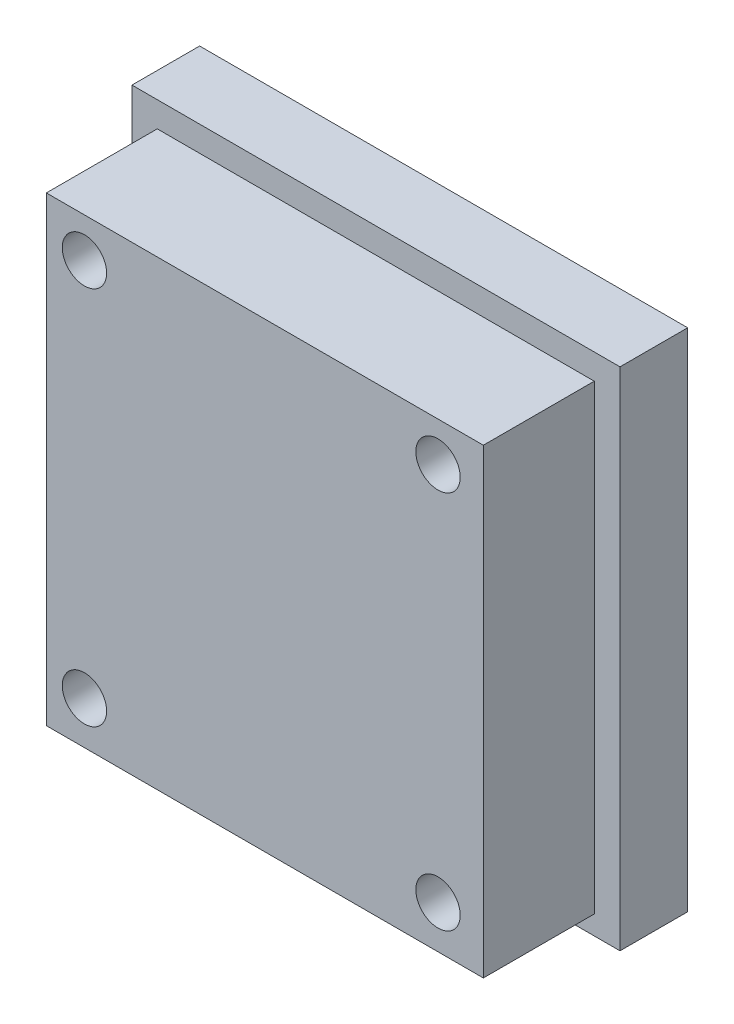
ISO-10303-21;
HEADER;
FILE_DESCRIPTION(('STEP AP214'),'2;1');
FILE_NAME('part.step','',(''),(''),'','','');
FILE_SCHEMA(('AUTOMOTIVE_DESIGN { 1 0 10303 214 1 1 1 1 }'));
ENDSEC;
DATA;
#1=APPLICATION_CONTEXT('core data for automotive mechanical design processes');
#2=APPLICATION_PROTOCOL_DEFINITION('international standard','automotive_design',2000,#1);
#3=PRODUCT_CONTEXT('',#1,'mechanical');
#4=PRODUCT('Part','Part','',(#3));
#5=PRODUCT_RELATED_PRODUCT_CATEGORY('part','',(#4));
#6=PRODUCT_DEFINITION_FORMATION('','',#4);
#7=PRODUCT_DEFINITION_CONTEXT('part definition',#1,'design');
#8=PRODUCT_DEFINITION('design','',#6,#7);
#9=PRODUCT_DEFINITION_SHAPE('','',#8);
#10=(LENGTH_UNIT() NAMED_UNIT(*) SI_UNIT(.MILLI.,.METRE.));
#11=(NAMED_UNIT(*) PLANE_ANGLE_UNIT() SI_UNIT($,.RADIAN.));
#12=(NAMED_UNIT(*) SI_UNIT($,.STERADIAN.) SOLID_ANGLE_UNIT());
#13=UNCERTAINTY_MEASURE_WITH_UNIT(LENGTH_MEASURE(1.E-05),#10,'distance_accuracy_value','');
#14=(GEOMETRIC_REPRESENTATION_CONTEXT(3) GLOBAL_UNCERTAINTY_ASSIGNED_CONTEXT((#13)) GLOBAL_UNIT_ASSIGNED_CONTEXT((#10,
#11,#12)) REPRESENTATION_CONTEXT('',''));
#15=CARTESIAN_POINT('',(0.,0.,0.));
#16=DIRECTION('',(0.,0.,1.));
#17=DIRECTION('',(1.,0.,0.));
#18=AXIS2_PLACEMENT_3D('',#15,#16,#17);
#19=CARTESIAN_POINT('',(-24.06,19.62,16.1));
#20=DIRECTION('',(0.,1.,0.));
#21=DIRECTION('',(0.,0.,1.));
#22=AXIS2_PLACEMENT_3D('',#19,#20,#21);
#23=PLANE('',#22);
#24=DIRECTION('',(-1.,0.,0.));
#25=VECTOR('',#24,1.);
#26=CARTESIAN_POINT('',(-24.06,19.62,6.1));
#27=LINE('',#26,#25);
#28=CARTESIAN_POINT('',(15.34,19.62,6.1));
#29=VERTEX_POINT('',#28);
#30=CARTESIAN_POINT('',(-24.06,19.62,6.1));
#31=VERTEX_POINT('',#30);
#32=EDGE_CURVE('E60',#29,#31,#27,.T.);
#33=ORIENTED_EDGE('',*,*,#32,.T.);
#34=DIRECTION('',(0.,0.,-1.));
#35=VECTOR('',#34,1.);
#36=CARTESIAN_POINT('',(-24.06,19.62,16.1));
#37=LINE('',#36,#35);
#38=CARTESIAN_POINT('',(-24.06,19.62,16.1));
#39=VERTEX_POINT('',#38);
#40=EDGE_CURVE('E11',#39,#31,#37,.T.);
#41=ORIENTED_EDGE('',*,*,#40,.F.);
#42=DIRECTION('',(1.,0.,0.));
#43=VECTOR('',#42,1.);
#44=CARTESIAN_POINT('',(-24.06,19.62,16.1));
#45=LINE('',#44,#43);
#46=CARTESIAN_POINT('',(15.34,19.62,16.1));
#47=VERTEX_POINT('',#46);
#48=EDGE_CURVE('E176',#39,#47,#45,.T.);
#49=ORIENTED_EDGE('',*,*,#48,.T.);
#50=DIRECTION('',(0.,0.,-1.));
#51=VECTOR('',#50,1.);
#52=CARTESIAN_POINT('',(15.34,19.62,16.1));
#53=LINE('',#52,#51);
#54=EDGE_CURVE('E46',#47,#29,#53,.T.);
#55=ORIENTED_EDGE('',*,*,#54,.T.);
#56=EDGE_LOOP('',(#33,#41,#49,#55));
#57=FACE_BOUND('',#56,.T.);
#58=ADVANCED_FACE('F43',(#57),#23,.T.);
#59=CARTESIAN_POINT('',(-24.06,19.62,16.1));
#60=DIRECTION('',(1.,0.,0.));
#61=DIRECTION('',(0.,0.,-1.));
#62=AXIS2_PLACEMENT_3D('',#59,#60,#61);
#63=PLANE('',#62);
#64=ORIENTED_EDGE('',*,*,#40,.T.);
#65=DIRECTION('',(0.,-1.,0.));
#66=VECTOR('',#65,1.);
#67=CARTESIAN_POINT('',(-24.06,19.62,6.1));
#68=LINE('',#67,#66);
#69=CARTESIAN_POINT('',(-24.06,-21.98,6.1));
#70=VERTEX_POINT('',#69);
#71=EDGE_CURVE('E66',#31,#70,#68,.T.);
#72=ORIENTED_EDGE('',*,*,#71,.T.);
#73=DIRECTION('',(0.,0.,-1.));
#74=VECTOR('',#73,1.);
#75=CARTESIAN_POINT('',(-24.06,-21.98,16.1));
#76=LINE('',#75,#74);
#77=CARTESIAN_POINT('',(-24.06,-21.98,16.1));
#78=VERTEX_POINT('',#77);
#79=EDGE_CURVE('E52',#78,#70,#76,.T.);
#80=ORIENTED_EDGE('',*,*,#79,.F.);
#81=DIRECTION('',(0.,-1.,0.));
#82=VECTOR('',#81,1.);
#83=CARTESIAN_POINT('',(-24.06,19.62,16.1));
#84=LINE('',#83,#82);
#85=EDGE_CURVE('E185',#39,#78,#84,.T.);
#86=ORIENTED_EDGE('',*,*,#85,.F.);
#87=EDGE_LOOP('',(#64,#72,#80,#86));
#88=FACE_BOUND('',#87,.T.);
#89=ADVANCED_FACE('F194',(#88),#63,.F.);
#90=CARTESIAN_POINT('',(-24.06,-21.98,16.1));
#91=DIRECTION('',(0.,1.,0.));
#92=DIRECTION('',(0.,0.,1.));
#93=AXIS2_PLACEMENT_3D('',#90,#91,#92);
#94=PLANE('',#93);
#95=ORIENTED_EDGE('',*,*,#79,.T.);
#96=DIRECTION('',(1.,0.,0.));
#97=VECTOR('',#96,1.);
#98=CARTESIAN_POINT('',(-24.06,-21.98,6.1));
#99=LINE('',#98,#97);
#100=CARTESIAN_POINT('',(15.34,-21.98,6.1));
#101=VERTEX_POINT('',#100);
#102=EDGE_CURVE('E122',#70,#101,#99,.T.);
#103=ORIENTED_EDGE('',*,*,#102,.T.);
#104=DIRECTION('',(0.,0.,-1.));
#105=VECTOR('',#104,1.);
#106=CARTESIAN_POINT('',(15.34,-21.98,16.1));
#107=LINE('',#106,#105);
#108=CARTESIAN_POINT('',(15.34,-21.98,16.1));
#109=VERTEX_POINT('',#108);
#110=EDGE_CURVE('E111',#109,#101,#107,.T.);
#111=ORIENTED_EDGE('',*,*,#110,.F.);
#112=DIRECTION('',(1.,0.,0.));
#113=VECTOR('',#112,1.);
#114=CARTESIAN_POINT('',(-24.06,-21.98,16.1));
#115=LINE('',#114,#113);
#116=EDGE_CURVE('E182',#78,#109,#115,.T.);
#117=ORIENTED_EDGE('',*,*,#116,.F.);
#118=EDGE_LOOP('',(#95,#103,#111,#117));
#119=FACE_BOUND('',#118,.T.);
#120=ADVANCED_FACE('F123',(#119),#94,.F.);
#121=CARTESIAN_POINT('',(15.34,19.62,16.1));
#122=DIRECTION('',(1.,0.,0.));
#123=DIRECTION('',(0.,1.,0.));
#124=AXIS2_PLACEMENT_3D('',#121,#122,#123);
#125=PLANE('',#124);
#126=DIRECTION('',(0.,1.,0.));
#127=VECTOR('',#126,1.);
#128=CARTESIAN_POINT('',(15.34,19.62,6.1));
#129=LINE('',#128,#127);
#130=EDGE_CURVE('E115',#101,#29,#129,.T.);
#131=ORIENTED_EDGE('',*,*,#130,.T.);
#132=ORIENTED_EDGE('',*,*,#54,.F.);
#133=DIRECTION('',(0.,-1.,0.));
#134=VECTOR('',#133,1.);
#135=CARTESIAN_POINT('',(15.34,19.62,16.1));
#136=LINE('',#135,#134);
#137=EDGE_CURVE('E117',#47,#109,#136,.T.);
#138=ORIENTED_EDGE('',*,*,#137,.T.);
#139=ORIENTED_EDGE('',*,*,#110,.T.);
#140=EDGE_LOOP('',(#131,#132,#138,#139));
#141=FACE_BOUND('',#140,.T.);
#142=ADVANCED_FACE('F113',(#141),#125,.T.);
#143=CARTESIAN_POINT('',(0.,0.,16.1));
#144=DIRECTION('',(0.,0.,-1.));
#145=DIRECTION('',(-1.,0.,0.));
#146=AXIS2_PLACEMENT_3D('',#143,#144,#145);
#147=PLANE('',#146);
#148=CARTESIAN_POINT('',(11.2536911867013,-18.1252242686097,16.1));
#149=DIRECTION('',(0.,0.,1.));
#150=DIRECTION('',(1.,0.,0.));
#151=AXIS2_PLACEMENT_3D('',#148,#149,#150);
#152=CIRCLE('',#151,2.);
#153=CARTESIAN_POINT('',(13.2536911867013,-18.1252242686097,16.1));
#154=VERTEX_POINT('',#153);
#155=EDGE_CURVE('E277',#154,#154,#152,.T.);
#156=ORIENTED_EDGE('',*,*,#155,.F.);
#157=EDGE_LOOP('',(#156));
#158=FACE_BOUND('',#157,.T.);
#159=CARTESIAN_POINT('',(11.2536911867013,16.0742191790854,16.1));
#160=DIRECTION('',(0.,0.,1.));
#161=DIRECTION('',(1.,0.,0.));
#162=AXIS2_PLACEMENT_3D('',#159,#160,#161);
#163=CIRCLE('',#162,2.);
#164=CARTESIAN_POINT('',(13.2536911867013,16.0742191790854,16.1));
#165=VERTEX_POINT('',#164);
#166=EDGE_CURVE('E267',#165,#165,#163,.T.);
#167=ORIENTED_EDGE('',*,*,#166,.F.);
#168=EDGE_LOOP('',(#167));
#169=FACE_BOUND('',#168,.T.);
#170=CARTESIAN_POINT('',(-20.6239551828933,16.0742191790854,16.1));
#171=DIRECTION('',(0.,0.,1.));
#172=DIRECTION('',(1.,0.,0.));
#173=AXIS2_PLACEMENT_3D('',#170,#171,#172);
#174=CIRCLE('',#173,2.);
#175=CARTESIAN_POINT('',(-18.6239551828933,16.0742191790854,16.1));
#176=VERTEX_POINT('',#175);
#177=EDGE_CURVE('E257',#176,#176,#174,.T.);
#178=ORIENTED_EDGE('',*,*,#177,.F.);
#179=EDGE_LOOP('',(#178));
#180=FACE_BOUND('',#179,.T.);
#181=CARTESIAN_POINT('',(-20.6239551828933,-18.1252242686097,16.1));
#182=DIRECTION('',(0.,0.,1.));
#183=DIRECTION('',(1.,0.,0.));
#184=AXIS2_PLACEMENT_3D('',#181,#182,#183);
#185=CIRCLE('',#184,2.);
#186=CARTESIAN_POINT('',(-18.6239551828933,-18.1252242686097,16.1));
#187=VERTEX_POINT('',#186);
#188=EDGE_CURVE('E260',#187,#187,#185,.T.);
#189=ORIENTED_EDGE('',*,*,#188,.F.);
#190=EDGE_LOOP('',(#189));
#191=FACE_BOUND('',#190,.T.);
#192=ORIENTED_EDGE('',*,*,#48,.F.);
#193=ORIENTED_EDGE('',*,*,#85,.T.);
#194=ORIENTED_EDGE('',*,*,#116,.T.);
#195=ORIENTED_EDGE('',*,*,#137,.F.);
#196=EDGE_LOOP('',(#192,#193,#194,#195));
#197=FACE_BOUND('',#196,.T.);
#198=ADVANCED_FACE('F192',(#158,#169,#180,#191,#197),#147,.F.);
#199=CARTESIAN_POINT('',(0.,0.,6.1));
#200=DIRECTION('',(0.,0.,1.));
#201=DIRECTION('',(1.,0.,0.));
#202=AXIS2_PLACEMENT_3D('',#199,#200,#201);
#203=PLANE('',#202);
#204=DIRECTION('',(0.,-1.,0.));
#205=VECTOR('',#204,1.);
#206=CARTESIAN_POINT('',(-26.34,21.9,6.1));
#207=LINE('',#206,#205);
#208=CARTESIAN_POINT('',(-26.34,21.9,6.1));
#209=VERTEX_POINT('',#208);
#210=CARTESIAN_POINT('',(-26.34,-23.7,6.1));
#211=VERTEX_POINT('',#210);
#212=EDGE_CURVE('E135',#209,#211,#207,.T.);
#213=ORIENTED_EDGE('',*,*,#212,.T.);
#214=DIRECTION('',(1.,0.,0.));
#215=VECTOR('',#214,1.);
#216=CARTESIAN_POINT('',(-26.34,-23.7,6.1));
#217=LINE('',#216,#215);
#218=CARTESIAN_POINT('',(17.66,-23.7,6.1));
#219=VERTEX_POINT('',#218);
#220=EDGE_CURVE('E139',#211,#219,#217,.T.);
#221=ORIENTED_EDGE('',*,*,#220,.T.);
#222=DIRECTION('',(0.,1.,0.));
#223=VECTOR('',#222,1.);
#224=CARTESIAN_POINT('',(17.66,21.9,6.1));
#225=LINE('',#224,#223);
#226=CARTESIAN_POINT('',(17.66,21.9,6.1));
#227=VERTEX_POINT('',#226);
#228=EDGE_CURVE('E143',#219,#227,#225,.T.);
#229=ORIENTED_EDGE('',*,*,#228,.T.);
#230=DIRECTION('',(-1.,0.,0.));
#231=VECTOR('',#230,1.);
#232=CARTESIAN_POINT('',(-26.34,21.9,6.1));
#233=LINE('',#232,#231);
#234=EDGE_CURVE('E146',#227,#209,#233,.T.);
#235=ORIENTED_EDGE('',*,*,#234,.T.);
#236=EDGE_LOOP('',(#213,#221,#229,#235));
#237=FACE_BOUND('',#236,.T.);
#238=ORIENTED_EDGE('',*,*,#102,.F.);
#239=ORIENTED_EDGE('',*,*,#71,.F.);
#240=ORIENTED_EDGE('',*,*,#32,.F.);
#241=ORIENTED_EDGE('',*,*,#130,.F.);
#242=EDGE_LOOP('',(#238,#239,#240,#241));
#243=FACE_BOUND('',#242,.T.);
#244=ADVANCED_FACE('F127',(#237,#243),#203,.T.);
#245=CARTESIAN_POINT('',(-26.34,21.9,6.1));
#246=DIRECTION('',(1.,0.,0.));
#247=DIRECTION('',(0.,0.,-1.));
#248=AXIS2_PLACEMENT_3D('',#245,#246,#247);
#249=PLANE('',#248);
#250=DIRECTION('',(0.,-1.,0.));
#251=VECTOR('',#250,1.);
#252=CARTESIAN_POINT('',(-26.34,21.9,0.));
#253=LINE('',#252,#251);
#254=CARTESIAN_POINT('',(-26.34,21.9,0.));
#255=VERTEX_POINT('',#254);
#256=CARTESIAN_POINT('',(-26.34,-23.7,0.));
#257=VERTEX_POINT('',#256);
#258=EDGE_CURVE('E131',#255,#257,#253,.T.);
#259=ORIENTED_EDGE('',*,*,#258,.T.);
#260=DIRECTION('',(0.,0.,-1.));
#261=VECTOR('',#260,1.);
#262=CARTESIAN_POINT('',(-26.34,-23.7,6.1));
#263=LINE('',#262,#261);
#264=EDGE_CURVE('E172',#211,#257,#263,.T.);
#265=ORIENTED_EDGE('',*,*,#264,.F.);
#266=ORIENTED_EDGE('',*,*,#212,.F.);
#267=DIRECTION('',(0.,0.,-1.));
#268=VECTOR('',#267,1.);
#269=CARTESIAN_POINT('',(-26.34,21.9,6.1));
#270=LINE('',#269,#268);
#271=EDGE_CURVE('E149',#209,#255,#270,.T.);
#272=ORIENTED_EDGE('',*,*,#271,.T.);
#273=EDGE_LOOP('',(#259,#265,#266,#272));
#274=FACE_BOUND('',#273,.T.);
#275=ADVANCED_FACE('F213',(#274),#249,.F.);
#276=CARTESIAN_POINT('',(-26.34,-23.7,6.1));
#277=DIRECTION('',(0.,1.,0.));
#278=DIRECTION('',(0.,0.,1.));
#279=AXIS2_PLACEMENT_3D('',#276,#277,#278);
#280=PLANE('',#279);
#281=DIRECTION('',(1.,0.,0.));
#282=VECTOR('',#281,1.);
#283=CARTESIAN_POINT('',(-26.34,-23.7,0.));
#284=LINE('',#283,#282);
#285=CARTESIAN_POINT('',(17.66,-23.7,0.));
#286=VERTEX_POINT('',#285);
#287=EDGE_CURVE('E153',#257,#286,#284,.T.);
#288=ORIENTED_EDGE('',*,*,#287,.T.);
#289=DIRECTION('',(0.,0.,-1.));
#290=VECTOR('',#289,1.);
#291=CARTESIAN_POINT('',(17.66,-23.7,6.1));
#292=LINE('',#291,#290);
#293=EDGE_CURVE('E168',#219,#286,#292,.T.);
#294=ORIENTED_EDGE('',*,*,#293,.F.);
#295=ORIENTED_EDGE('',*,*,#220,.F.);
#296=ORIENTED_EDGE('',*,*,#264,.T.);
#297=EDGE_LOOP('',(#288,#294,#295,#296));
#298=FACE_BOUND('',#297,.T.);
#299=ADVANCED_FACE('F221',(#298),#280,.F.);
#300=CARTESIAN_POINT('',(17.66,21.9,6.1));
#301=DIRECTION('',(-1.,0.,0.));
#302=DIRECTION('',(0.,0.,1.));
#303=AXIS2_PLACEMENT_3D('',#300,#301,#302);
#304=PLANE('',#303);
#305=DIRECTION('',(0.,1.,0.));
#306=VECTOR('',#305,1.);
#307=CARTESIAN_POINT('',(17.66,21.9,0.));
#308=LINE('',#307,#306);
#309=CARTESIAN_POINT('',(17.66,21.9,0.));
#310=VERTEX_POINT('',#309);
#311=EDGE_CURVE('E156',#286,#310,#308,.T.);
#312=ORIENTED_EDGE('',*,*,#311,.T.);
#313=DIRECTION('',(0.,0.,-1.));
#314=VECTOR('',#313,1.);
#315=CARTESIAN_POINT('',(17.66,21.9,6.1));
#316=LINE('',#315,#314);
#317=EDGE_CURVE('E164',#227,#310,#316,.T.);
#318=ORIENTED_EDGE('',*,*,#317,.F.);
#319=ORIENTED_EDGE('',*,*,#228,.F.);
#320=ORIENTED_EDGE('',*,*,#293,.T.);
#321=EDGE_LOOP('',(#312,#318,#319,#320));
#322=FACE_BOUND('',#321,.T.);
#323=ADVANCED_FACE('F225',(#322),#304,.F.);
#324=CARTESIAN_POINT('',(-26.34,21.9,6.1));
#325=DIRECTION('',(0.,-1.,0.));
#326=DIRECTION('',(0.,0.,-1.));
#327=AXIS2_PLACEMENT_3D('',#324,#325,#326);
#328=PLANE('',#327);
#329=DIRECTION('',(-1.,0.,0.));
#330=VECTOR('',#329,1.);
#331=CARTESIAN_POINT('',(-26.34,21.9,0.));
#332=LINE('',#331,#330);
#333=EDGE_CURVE('E140',#310,#255,#332,.T.);
#334=ORIENTED_EDGE('',*,*,#333,.T.);
#335=ORIENTED_EDGE('',*,*,#271,.F.);
#336=ORIENTED_EDGE('',*,*,#234,.F.);
#337=ORIENTED_EDGE('',*,*,#317,.T.);
#338=EDGE_LOOP('',(#334,#335,#336,#337));
#339=FACE_BOUND('',#338,.T.);
#340=ADVANCED_FACE('F229',(#339),#328,.F.);
#341=CARTESIAN_POINT('',(0.,0.,0.));
#342=DIRECTION('',(0.,0.,-1.));
#343=DIRECTION('',(-1.,0.,0.));
#344=AXIS2_PLACEMENT_3D('',#341,#342,#343);
#345=PLANE('',#344);
#346=CARTESIAN_POINT('',(11.2536911867013,-18.1252242686097,0.));
#347=DIRECTION('',(0.,0.,1.));
#348=DIRECTION('',(1.,0.,0.));
#349=AXIS2_PLACEMENT_3D('',#346,#347,#348);
#350=CIRCLE('',#349,2.);
#351=CARTESIAN_POINT('',(13.2536911867013,-18.1252242686097,0.));
#352=VERTEX_POINT('',#351);
#353=EDGE_CURVE('E281',#352,#352,#350,.T.);
#354=ORIENTED_EDGE('',*,*,#353,.T.);
#355=EDGE_LOOP('',(#354));
#356=FACE_BOUND('',#355,.T.);
#357=CARTESIAN_POINT('',(11.2536911867013,16.0742191790854,0.));
#358=DIRECTION('',(0.,0.,1.));
#359=DIRECTION('',(1.,0.,0.));
#360=AXIS2_PLACEMENT_3D('',#357,#358,#359);
#361=CIRCLE('',#360,2.);
#362=CARTESIAN_POINT('',(13.2536911867013,16.0742191790854,0.));
#363=VERTEX_POINT('',#362);
#364=EDGE_CURVE('E273',#363,#363,#361,.T.);
#365=ORIENTED_EDGE('',*,*,#364,.T.);
#366=EDGE_LOOP('',(#365));
#367=FACE_BOUND('',#366,.T.);
#368=CARTESIAN_POINT('',(-20.6239551828933,16.0742191790854,0.));
#369=DIRECTION('',(0.,0.,1.));
#370=DIRECTION('',(1.,0.,0.));
#371=AXIS2_PLACEMENT_3D('',#368,#369,#370);
#372=CIRCLE('',#371,2.);
#373=CARTESIAN_POINT('',(-18.6239551828933,16.0742191790854,0.));
#374=VERTEX_POINT('',#373);
#375=EDGE_CURVE('E254',#374,#374,#372,.T.);
#376=ORIENTED_EDGE('',*,*,#375,.T.);
#377=EDGE_LOOP('',(#376));
#378=FACE_BOUND('',#377,.T.);
#379=CARTESIAN_POINT('',(-20.6239551828933,-18.1252242686097,0.));
#380=DIRECTION('',(0.,0.,1.));
#381=DIRECTION('',(1.,0.,0.));
#382=AXIS2_PLACEMENT_3D('',#379,#380,#381);
#383=CIRCLE('',#382,2.);
#384=CARTESIAN_POINT('',(-18.6239551828933,-18.1252242686097,0.));
#385=VERTEX_POINT('',#384);
#386=EDGE_CURVE('E265',#385,#385,#383,.T.);
#387=ORIENTED_EDGE('',*,*,#386,.T.);
#388=EDGE_LOOP('',(#387));
#389=FACE_BOUND('',#388,.T.);
#390=ORIENTED_EDGE('',*,*,#258,.F.);
#391=ORIENTED_EDGE('',*,*,#333,.F.);
#392=ORIENTED_EDGE('',*,*,#311,.F.);
#393=ORIENTED_EDGE('',*,*,#287,.F.);
#394=EDGE_LOOP('',(#390,#391,#392,#393));
#395=FACE_BOUND('',#394,.T.);
#396=ADVANCED_FACE('F203',(#356,#367,#378,#389,#395),#345,.T.);
#397=CARTESIAN_POINT('',(-20.6239551828933,-18.1252242686097,0.));
#398=DIRECTION('',(0.,0.,1.));
#399=DIRECTION('',(1.,0.,0.));
#400=AXIS2_PLACEMENT_3D('',#397,#398,#399);
#401=CYLINDRICAL_SURFACE('',#400,2.);
#402=ORIENTED_EDGE('',*,*,#386,.F.);
#403=EDGE_LOOP('',(#402));
#404=FACE_BOUND('',#403,.T.);
#405=ORIENTED_EDGE('',*,*,#188,.T.);
#406=EDGE_LOOP('',(#405));
#407=FACE_BOUND('',#406,.T.);
#408=ADVANCED_FACE('F234',(#404,#407),#401,.F.);
#409=CARTESIAN_POINT('',(-20.6239551828933,16.0742191790854,0.));
#410=DIRECTION('',(0.,0.,1.));
#411=DIRECTION('',(1.,0.,0.));
#412=AXIS2_PLACEMENT_3D('',#409,#410,#411);
#413=CYLINDRICAL_SURFACE('',#412,2.);
#414=ORIENTED_EDGE('',*,*,#375,.F.);
#415=EDGE_LOOP('',(#414));
#416=FACE_BOUND('',#415,.T.);
#417=ORIENTED_EDGE('',*,*,#177,.T.);
#418=EDGE_LOOP('',(#417));
#419=FACE_BOUND('',#418,.T.);
#420=ADVANCED_FACE('F237',(#416,#419),#413,.F.);
#421=CARTESIAN_POINT('',(11.2536911867013,16.0742191790854,0.));
#422=DIRECTION('',(0.,0.,1.));
#423=DIRECTION('',(1.,0.,0.));
#424=AXIS2_PLACEMENT_3D('',#421,#422,#423);
#425=CYLINDRICAL_SURFACE('',#424,2.);
#426=ORIENTED_EDGE('',*,*,#364,.F.);
#427=EDGE_LOOP('',(#426));
#428=FACE_BOUND('',#427,.T.);
#429=ORIENTED_EDGE('',*,*,#166,.T.);
#430=EDGE_LOOP('',(#429));
#431=FACE_BOUND('',#430,.T.);
#432=ADVANCED_FACE('F242',(#428,#431),#425,.F.);
#433=CARTESIAN_POINT('',(11.2536911867013,-18.1252242686097,0.));
#434=DIRECTION('',(0.,0.,1.));
#435=DIRECTION('',(1.,0.,0.));
#436=AXIS2_PLACEMENT_3D('',#433,#434,#435);
#437=CYLINDRICAL_SURFACE('',#436,2.);
#438=ORIENTED_EDGE('',*,*,#353,.F.);
#439=EDGE_LOOP('',(#438));
#440=FACE_BOUND('',#439,.T.);
#441=ORIENTED_EDGE('',*,*,#155,.T.);
#442=EDGE_LOOP('',(#441));
#443=FACE_BOUND('',#442,.T.);
#444=ADVANCED_FACE('F239',(#440,#443),#437,.F.);
#445=CLOSED_SHELL('',(#58,#89,#120,#142,#198,#244,#275,#299,#323,#340,#396,#408,#420,#432,#444));
#446=MANIFOLD_SOLID_BREP('B2',#445);
#447=ADVANCED_BREP_SHAPE_REPRESENTATION('',(#18,#446),#14);
#448=SHAPE_DEFINITION_REPRESENTATION(#9,#447);
ENDSEC;
END-ISO-10303-21;
